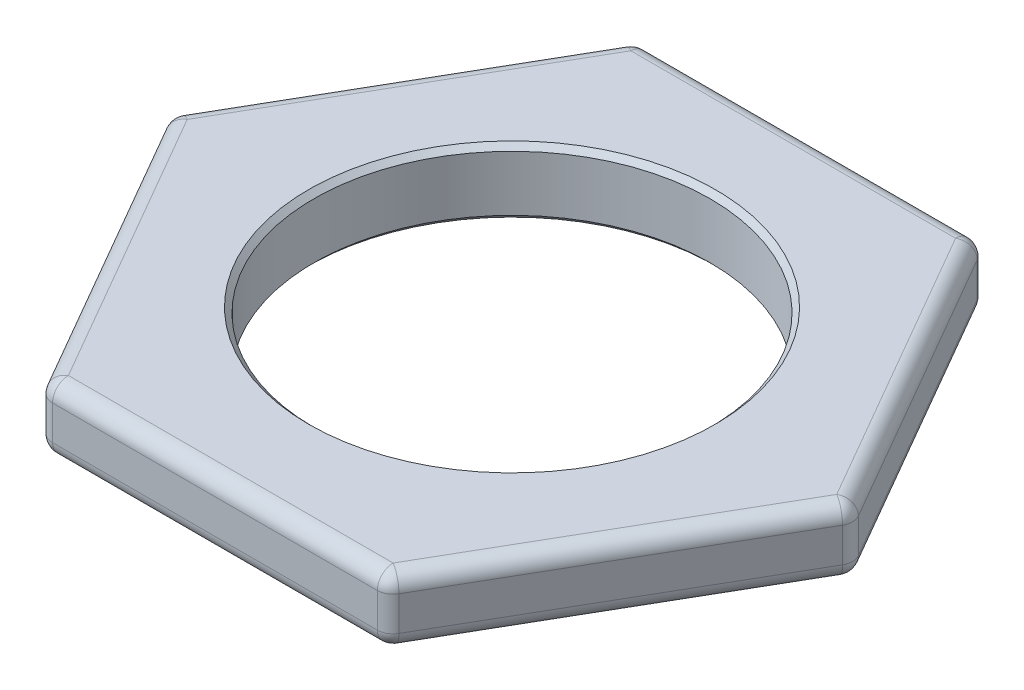
ISO-10303-21;
HEADER;
FILE_DESCRIPTION(('STEP AP214'),'2;1');
FILE_NAME('part.step','',(''),(''),'','','');
FILE_SCHEMA(('AUTOMOTIVE_DESIGN { 1 0 10303 214 1 1 1 1 }'));
ENDSEC;
DATA;
#1=APPLICATION_CONTEXT('core data for automotive mechanical design processes');
#2=APPLICATION_PROTOCOL_DEFINITION('international standard','automotive_design',2000,#1);
#3=PRODUCT_CONTEXT('',#1,'mechanical');
#4=PRODUCT('Part','Part','',(#3));
#5=PRODUCT_RELATED_PRODUCT_CATEGORY('part','',(#4));
#6=PRODUCT_DEFINITION_FORMATION('','',#4);
#7=PRODUCT_DEFINITION_CONTEXT('part definition',#1,'design');
#8=PRODUCT_DEFINITION('design','',#6,#7);
#9=PRODUCT_DEFINITION_SHAPE('','',#8);
#10=(LENGTH_UNIT() NAMED_UNIT(*) SI_UNIT(.MILLI.,.METRE.));
#11=(NAMED_UNIT(*) PLANE_ANGLE_UNIT() SI_UNIT($,.RADIAN.));
#12=(NAMED_UNIT(*) SI_UNIT($,.STERADIAN.) SOLID_ANGLE_UNIT());
#13=UNCERTAINTY_MEASURE_WITH_UNIT(LENGTH_MEASURE(1.E-05),#10,'distance_accuracy_value','');
#14=(GEOMETRIC_REPRESENTATION_CONTEXT(3) GLOBAL_UNCERTAINTY_ASSIGNED_CONTEXT((#13)) GLOBAL_UNIT_ASSIGNED_CONTEXT((#10,
#11,#12)) REPRESENTATION_CONTEXT('',''));
#15=CARTESIAN_POINT('',(0.,0.,0.));
#16=DIRECTION('',(0.,0.,1.));
#17=DIRECTION('',(1.,0.,0.));
#18=AXIS2_PLACEMENT_3D('',#15,#16,#17);
#19=CARTESIAN_POINT('',(0.,3.175,0.));
#20=DIRECTION('',(0.,1.,0.));
#21=DIRECTION('',(0.,0.,1.));
#22=AXIS2_PLACEMENT_3D('',#19,#20,#21);
#23=PLANE('',#22);
#24=DIRECTION('',(-0.5,0.,0.866025403784438));
#25=VECTOR('',#24,1.);
#26=CARTESIAN_POINT('',(-15.8378725844098,3.175,0.380999999999995));
#27=LINE('',#26,#25);
#28=CARTESIAN_POINT('',(-7.80895106592428,3.175,-13.5255));
#29=VERTEX_POINT('',#28);
#30=CARTESIAN_POINT('',(-15.6179021318486,3.175,0.));
#31=VERTEX_POINT('',#30);
#32=EDGE_CURVE('E311',#29,#31,#27,.T.);
#33=ORIENTED_EDGE('',*,*,#32,.T.);
#34=DIRECTION('',(0.5,0.,0.866025403784439));
#35=VECTOR('',#34,1.);
#36=CARTESIAN_POINT('',(-7.58898061336304,3.175,13.9065));
#37=LINE('',#36,#35);
#38=CARTESIAN_POINT('',(-7.80895106592429,3.175,13.5255));
#39=VERTEX_POINT('',#38);
#40=EDGE_CURVE('E313',#31,#39,#37,.T.);
#41=ORIENTED_EDGE('',*,*,#40,.T.);
#42=DIRECTION('',(1.,0.,0.));
#43=VECTOR('',#42,1.);
#44=CARTESIAN_POINT('',(8.24889197104678,3.175,13.5255));
#45=LINE('',#44,#43);
#46=CARTESIAN_POINT('',(7.80895106592428,3.175,13.5255));
#47=VERTEX_POINT('',#46);
#48=EDGE_CURVE('E303',#39,#47,#45,.T.);
#49=ORIENTED_EDGE('',*,*,#48,.T.);
#50=DIRECTION('',(0.5,0.,-0.866025403784439));
#51=VECTOR('',#50,1.);
#52=CARTESIAN_POINT('',(15.8378725844098,3.175,-0.381000000000002));
#53=LINE('',#52,#51);
#54=CARTESIAN_POINT('',(15.6179021318486,3.175,0.));
#55=VERTEX_POINT('',#54);
#56=EDGE_CURVE('E305',#47,#55,#53,.T.);
#57=ORIENTED_EDGE('',*,*,#56,.T.);
#58=DIRECTION('',(-0.5,0.,-0.866025403784439));
#59=VECTOR('',#58,1.);
#60=CARTESIAN_POINT('',(7.58898061336305,3.175,-13.9065));
#61=LINE('',#60,#59);
#62=CARTESIAN_POINT('',(7.80895106592429,3.175,-13.5255));
#63=VERTEX_POINT('',#62);
#64=EDGE_CURVE('E307',#55,#63,#61,.T.);
#65=ORIENTED_EDGE('',*,*,#64,.T.);
#66=DIRECTION('',(-1.,0.,0.));
#67=VECTOR('',#66,1.);
#68=CARTESIAN_POINT('',(-8.24889197104678,3.175,-13.5255));
#69=LINE('',#68,#67);
#70=EDGE_CURVE('E309',#63,#29,#69,.T.);
#71=ORIENTED_EDGE('',*,*,#70,.T.);
#72=EDGE_LOOP('',(#33,#41,#49,#57,#65,#71));
#73=FACE_BOUND('',#72,.T.);
#74=CARTESIAN_POINT('',(0.,3.175,0.));
#75=DIRECTION('',(0.,1.,0.));
#76=DIRECTION('',(0.,0.,1.));
#77=AXIS2_PLACEMENT_3D('',#74,#75,#76);
#78=CIRCLE('',#77,9.77900000000001);
#79=CARTESIAN_POINT('',(0.,3.175,9.77900000000001));
#80=VERTEX_POINT('',#79);
#81=EDGE_CURVE('E180',#80,#80,#78,.F.);
#82=ORIENTED_EDGE('',*,*,#81,.T.);
#83=EDGE_LOOP('',(#82));
#84=FACE_BOUND('',#83,.T.);
#85=ADVANCED_FACE('F35',(#73,#84),#23,.T.);
#86=CARTESIAN_POINT('',(0.,0.,0.));
#87=DIRECTION('',(0.,1.,0.));
#88=DIRECTION('',(0.,0.,1.));
#89=AXIS2_PLACEMENT_3D('',#86,#87,#88);
#90=PLANE('',#89);
#91=DIRECTION('',(1.,0.,0.));
#92=VECTOR('',#91,1.);
#93=CARTESIAN_POINT('',(0.,0.,13.5255));
#94=LINE('',#93,#92);
#95=CARTESIAN_POINT('',(7.80895106592428,0.,13.5255));
#96=VERTEX_POINT('',#95);
#97=CARTESIAN_POINT('',(-7.80895106592429,0.,13.5255));
#98=VERTEX_POINT('',#97);
#99=EDGE_CURVE('E316',#96,#98,#94,.F.);
#100=ORIENTED_EDGE('',*,*,#99,.T.);
#101=DIRECTION('',(0.5,0.,0.866025403784439));
#102=VECTOR('',#101,1.);
#103=CARTESIAN_POINT('',(-11.7134265988864,0.,6.76275));
#104=LINE('',#103,#102);
#105=CARTESIAN_POINT('',(-15.6179021318486,0.,0.));
#106=VERTEX_POINT('',#105);
#107=EDGE_CURVE('E192',#98,#106,#104,.F.);
#108=ORIENTED_EDGE('',*,*,#107,.T.);
#109=DIRECTION('',(-0.5,0.,0.866025403784438));
#110=VECTOR('',#109,1.);
#111=CARTESIAN_POINT('',(-11.7134265988864,0.,-6.76275000000001));
#112=LINE('',#111,#110);
#113=CARTESIAN_POINT('',(-7.80895106592429,0.,-13.5255));
#114=VERTEX_POINT('',#113);
#115=EDGE_CURVE('E324',#106,#114,#112,.F.);
#116=ORIENTED_EDGE('',*,*,#115,.T.);
#117=DIRECTION('',(-1.,0.,0.));
#118=VECTOR('',#117,1.);
#119=CARTESIAN_POINT('',(0.,0.,-13.5255));
#120=LINE('',#119,#118);
#121=CARTESIAN_POINT('',(7.80895106592429,0.,-13.5255));
#122=VERTEX_POINT('',#121);
#123=EDGE_CURVE('E322',#114,#122,#120,.F.);
#124=ORIENTED_EDGE('',*,*,#123,.T.);
#125=DIRECTION('',(-0.5,0.,-0.866025403784439));
#126=VECTOR('',#125,1.);
#127=CARTESIAN_POINT('',(11.7134265988864,0.,-6.76275));
#128=LINE('',#127,#126);
#129=CARTESIAN_POINT('',(15.6179021318486,0.,0.));
#130=VERTEX_POINT('',#129);
#131=EDGE_CURVE('E320',#122,#130,#128,.F.);
#132=ORIENTED_EDGE('',*,*,#131,.T.);
#133=DIRECTION('',(0.5,0.,-0.866025403784439));
#134=VECTOR('',#133,1.);
#135=CARTESIAN_POINT('',(11.7134265988864,0.,6.76275));
#136=LINE('',#135,#134);
#137=EDGE_CURVE('E318',#130,#96,#136,.F.);
#138=ORIENTED_EDGE('',*,*,#137,.T.);
#139=EDGE_LOOP('',(#100,#108,#116,#124,#132,#138));
#140=FACE_BOUND('',#139,.T.);
#141=CARTESIAN_POINT('',(0.,0.,0.));
#142=DIRECTION('',(0.,1.,0.));
#143=DIRECTION('',(0.,0.,1.));
#144=AXIS2_PLACEMENT_3D('',#141,#142,#143);
#145=CIRCLE('',#144,9.779);
#146=CARTESIAN_POINT('',(0.,0.,9.779));
#147=VERTEX_POINT('',#146);
#148=EDGE_CURVE('E274',#147,#147,#145,.T.);
#149=ORIENTED_EDGE('',*,*,#148,.T.);
#150=EDGE_LOOP('',(#149));
#151=FACE_BOUND('',#150,.T.);
#152=ADVANCED_FACE('F397',(#140,#151),#90,.F.);
#153=CARTESIAN_POINT('',(-16.4977839420936,3.175,0.));
#154=DIRECTION('',(0.866025403784439,0.,-0.5));
#155=DIRECTION('',(-0.5,0.,-0.866025403784439));
#156=AXIS2_PLACEMENT_3D('',#153,#154,#155);
#157=PLANE('',#156);
#158=DIRECTION('',(0.5,0.,0.866025403784439));
#159=VECTOR('',#158,1.);
#160=CARTESIAN_POINT('',(-16.4977839420936,2.413,0.));
#161=LINE('',#160,#159);
#162=CARTESIAN_POINT('',(-8.46886242360803,2.413,13.9065));
#163=VERTEX_POINT('',#162);
#164=CARTESIAN_POINT('',(-16.2778134895323,2.413,0.380999999999995));
#165=VERTEX_POINT('',#164);
#166=EDGE_CURVE('E169',#163,#165,#161,.F.);
#167=ORIENTED_EDGE('',*,*,#166,.T.);
#168=DIRECTION('',(0.,-1.,0.));
#169=VECTOR('',#168,1.);
#170=CARTESIAN_POINT('',(-16.2778134895323,3.175,0.380999999999994));
#171=LINE('',#170,#169);
#172=CARTESIAN_POINT('',(-16.2778134895323,0.762,0.380999999999995));
#173=VERTEX_POINT('',#172);
#174=EDGE_CURVE('E165',#165,#173,#171,.T.);
#175=ORIENTED_EDGE('',*,*,#174,.T.);
#176=DIRECTION('',(0.5,0.,0.866025403784439));
#177=VECTOR('',#176,1.);
#178=CARTESIAN_POINT('',(-16.4977839420936,0.762,0.));
#179=LINE('',#178,#177);
#180=CARTESIAN_POINT('',(-8.46886242360803,0.762,13.9065));
#181=VERTEX_POINT('',#180);
#182=EDGE_CURVE('E159',#173,#181,#179,.T.);
#183=ORIENTED_EDGE('',*,*,#182,.T.);
#184=DIRECTION('',(0.,-1.,0.));
#185=VECTOR('',#184,1.);
#186=CARTESIAN_POINT('',(-8.46886242360803,3.175,13.9065));
#187=LINE('',#186,#185);
#188=EDGE_CURVE('E162',#181,#163,#187,.F.);
#189=ORIENTED_EDGE('',*,*,#188,.T.);
#190=EDGE_LOOP('',(#167,#175,#183,#189));
#191=FACE_BOUND('',#190,.T.);
#192=ADVANCED_FACE('F161',(#191),#157,.F.);
#193=CARTESIAN_POINT('',(-8.24889197104678,3.175,14.2875));
#194=DIRECTION('',(0.,0.,-1.));
#195=DIRECTION('',(-1.,0.,0.));
#196=AXIS2_PLACEMENT_3D('',#193,#194,#195);
#197=PLANE('',#196);
#198=DIRECTION('',(0.,-1.,0.));
#199=VECTOR('',#198,1.);
#200=CARTESIAN_POINT('',(-7.80895106592429,3.175,14.2875));
#201=LINE('',#200,#199);
#202=CARTESIAN_POINT('',(-7.80895106592429,2.413,14.2875));
#203=VERTEX_POINT('',#202);
#204=CARTESIAN_POINT('',(-7.80895106592429,0.762,14.2875));
#205=VERTEX_POINT('',#204);
#206=EDGE_CURVE('E55',#203,#205,#201,.T.);
#207=ORIENTED_EDGE('',*,*,#206,.T.);
#208=DIRECTION('',(1.,0.,0.));
#209=VECTOR('',#208,1.);
#210=CARTESIAN_POINT('',(-8.24889197104678,0.762,14.2875));
#211=LINE('',#210,#209);
#212=CARTESIAN_POINT('',(7.80895106592428,0.762,14.2875));
#213=VERTEX_POINT('',#212);
#214=EDGE_CURVE('E11',#205,#213,#211,.T.);
#215=ORIENTED_EDGE('',*,*,#214,.T.);
#216=DIRECTION('',(0.,-1.,0.));
#217=VECTOR('',#216,1.);
#218=CARTESIAN_POINT('',(7.80895106592428,3.175,14.2875));
#219=LINE('',#218,#217);
#220=CARTESIAN_POINT('',(7.80895106592428,2.413,14.2875));
#221=VERTEX_POINT('',#220);
#222=EDGE_CURVE('E44',#213,#221,#219,.F.);
#223=ORIENTED_EDGE('',*,*,#222,.T.);
#224=DIRECTION('',(1.,0.,0.));
#225=VECTOR('',#224,1.);
#226=CARTESIAN_POINT('',(-8.24889197104678,2.413,14.2875));
#227=LINE('',#226,#225);
#228=EDGE_CURVE('E354',#221,#203,#227,.F.);
#229=ORIENTED_EDGE('',*,*,#228,.T.);
#230=EDGE_LOOP('',(#207,#215,#223,#229));
#231=FACE_BOUND('',#230,.T.);
#232=ADVANCED_FACE('F412',(#231),#197,.F.);
#233=CARTESIAN_POINT('',(8.24889197104678,3.175,14.2875));
#234=DIRECTION('',(-0.866025403784438,0.,-0.5));
#235=DIRECTION('',(-0.5,0.,0.866025403784439));
#236=AXIS2_PLACEMENT_3D('',#233,#234,#235);
#237=PLANE('',#236);
#238=DIRECTION('',(0.,-1.,0.));
#239=VECTOR('',#238,1.);
#240=CARTESIAN_POINT('',(8.46886242360802,3.175,13.9065));
#241=LINE('',#240,#239);
#242=CARTESIAN_POINT('',(8.46886242360802,2.413,13.9065));
#243=VERTEX_POINT('',#242);
#244=CARTESIAN_POINT('',(8.46886242360802,0.762,13.9065));
#245=VERTEX_POINT('',#244);
#246=EDGE_CURVE('E347',#243,#245,#241,.T.);
#247=ORIENTED_EDGE('',*,*,#246,.T.);
#248=DIRECTION('',(0.5,0.,-0.866025403784439));
#249=VECTOR('',#248,1.);
#250=CARTESIAN_POINT('',(8.24889197104678,0.762,14.2875));
#251=LINE('',#250,#249);
#252=CARTESIAN_POINT('',(16.2778134895323,0.762,0.381000000000001));
#253=VERTEX_POINT('',#252);
#254=EDGE_CURVE('E352',#245,#253,#251,.T.);
#255=ORIENTED_EDGE('',*,*,#254,.T.);
#256=DIRECTION('',(0.,-1.,0.));
#257=VECTOR('',#256,1.);
#258=CARTESIAN_POINT('',(16.2778134895323,3.175,0.380999999999999));
#259=LINE('',#258,#257);
#260=CARTESIAN_POINT('',(16.2778134895323,2.413,0.381000000000001));
#261=VERTEX_POINT('',#260);
#262=EDGE_CURVE('E349',#253,#261,#259,.F.);
#263=ORIENTED_EDGE('',*,*,#262,.T.);
#264=DIRECTION('',(0.5,0.,-0.866025403784439));
#265=VECTOR('',#264,1.);
#266=CARTESIAN_POINT('',(8.24889197104677,2.413,14.2875));
#267=LINE('',#266,#265);
#268=EDGE_CURVE('E345',#261,#243,#267,.F.);
#269=ORIENTED_EDGE('',*,*,#268,.T.);
#270=EDGE_LOOP('',(#247,#255,#263,#269));
#271=FACE_BOUND('',#270,.T.);
#272=ADVANCED_FACE('F472',(#271),#237,.F.);
#273=CARTESIAN_POINT('',(16.4977839420936,3.175,0.));
#274=DIRECTION('',(-0.866025403784439,0.,0.5));
#275=DIRECTION('',(0.5,0.,0.866025403784439));
#276=AXIS2_PLACEMENT_3D('',#273,#274,#275);
#277=PLANE('',#276);
#278=DIRECTION('',(-0.5,0.,-0.866025403784439));
#279=VECTOR('',#278,1.);
#280=CARTESIAN_POINT('',(16.4977839420936,0.762,0.));
#281=LINE('',#280,#279);
#282=CARTESIAN_POINT('',(16.2778134895323,0.762,-0.381000000000001));
#283=VERTEX_POINT('',#282);
#284=CARTESIAN_POINT('',(8.46886242360804,0.762,-13.9065));
#285=VERTEX_POINT('',#284);
#286=EDGE_CURVE('E340',#283,#285,#281,.T.);
#287=ORIENTED_EDGE('',*,*,#286,.T.);
#288=DIRECTION('',(0.,-1.,0.));
#289=VECTOR('',#288,1.);
#290=CARTESIAN_POINT('',(8.46886242360804,3.175,-13.9065));
#291=LINE('',#290,#289);
#292=CARTESIAN_POINT('',(8.46886242360804,2.413,-13.9065));
#293=VERTEX_POINT('',#292);
#294=EDGE_CURVE('E342',#285,#293,#291,.F.);
#295=ORIENTED_EDGE('',*,*,#294,.T.);
#296=DIRECTION('',(-0.5,0.,-0.866025403784439));
#297=VECTOR('',#296,1.);
#298=CARTESIAN_POINT('',(16.4977839420936,2.413,0.));
#299=LINE('',#298,#297);
#300=CARTESIAN_POINT('',(16.2778134895323,2.413,-0.381000000000001));
#301=VERTEX_POINT('',#300);
#302=EDGE_CURVE('E338',#293,#301,#299,.F.);
#303=ORIENTED_EDGE('',*,*,#302,.T.);
#304=DIRECTION('',(0.,-1.,0.));
#305=VECTOR('',#304,1.);
#306=CARTESIAN_POINT('',(16.2778134895323,3.175,-0.381000000000001));
#307=LINE('',#306,#305);
#308=EDGE_CURVE('E336',#301,#283,#307,.T.);
#309=ORIENTED_EDGE('',*,*,#308,.T.);
#310=EDGE_LOOP('',(#287,#295,#303,#309));
#311=FACE_BOUND('',#310,.T.);
#312=ADVANCED_FACE('F463',(#311),#277,.F.);
#313=CARTESIAN_POINT('',(8.24889197104679,3.175,-14.2875));
#314=DIRECTION('',(0.,0.,1.));
#315=DIRECTION('',(1.,0.,0.));
#316=AXIS2_PLACEMENT_3D('',#313,#314,#315);
#317=PLANE('',#316);
#318=DIRECTION('',(-1.,0.,0.));
#319=VECTOR('',#318,1.);
#320=CARTESIAN_POINT('',(8.24889197104679,0.762,-14.2875));
#321=LINE('',#320,#319);
#322=CARTESIAN_POINT('',(7.80895106592429,0.762,-14.2875));
#323=VERTEX_POINT('',#322);
#324=CARTESIAN_POINT('',(-7.80895106592429,0.762,-14.2875));
#325=VERTEX_POINT('',#324);
#326=EDGE_CURVE('E331',#323,#325,#321,.T.);
#327=ORIENTED_EDGE('',*,*,#326,.T.);
#328=DIRECTION('',(0.,-1.,0.));
#329=VECTOR('',#328,1.);
#330=CARTESIAN_POINT('',(-7.80895106592429,3.175,-14.2875));
#331=LINE('',#330,#329);
#332=CARTESIAN_POINT('',(-7.80895106592429,2.413,-14.2875));
#333=VERTEX_POINT('',#332);
#334=EDGE_CURVE('E333',#325,#333,#331,.F.);
#335=ORIENTED_EDGE('',*,*,#334,.T.);
#336=DIRECTION('',(-1.,0.,0.));
#337=VECTOR('',#336,1.);
#338=CARTESIAN_POINT('',(8.24889197104679,2.413,-14.2875));
#339=LINE('',#338,#337);
#340=CARTESIAN_POINT('',(7.80895106592429,2.413,-14.2875));
#341=VERTEX_POINT('',#340);
#342=EDGE_CURVE('E329',#333,#341,#339,.F.);
#343=ORIENTED_EDGE('',*,*,#342,.T.);
#344=DIRECTION('',(0.,-1.,0.));
#345=VECTOR('',#344,1.);
#346=CARTESIAN_POINT('',(7.80895106592429,3.175,-14.2875));
#347=LINE('',#346,#345);
#348=EDGE_CURVE('E327',#341,#323,#347,.T.);
#349=ORIENTED_EDGE('',*,*,#348,.T.);
#350=EDGE_LOOP('',(#327,#335,#343,#349));
#351=FACE_BOUND('',#350,.T.);
#352=ADVANCED_FACE('F502',(#351),#317,.F.);
#353=CARTESIAN_POINT('',(-8.24889197104678,3.175,-14.2875));
#354=DIRECTION('',(0.866025403784438,0.,0.5));
#355=DIRECTION('',(0.5,0.,-0.866025403784438));
#356=AXIS2_PLACEMENT_3D('',#353,#354,#355);
#357=PLANE('',#356);
#358=DIRECTION('',(-0.5,0.,0.866025403784438));
#359=VECTOR('',#358,1.);
#360=CARTESIAN_POINT('',(-8.24889197104678,0.762,-14.2875));
#361=LINE('',#360,#359);
#362=CARTESIAN_POINT('',(-8.46886242360803,0.762,-13.9065));
#363=VERTEX_POINT('',#362);
#364=CARTESIAN_POINT('',(-16.2778134895323,0.762,-0.381000000000008));
#365=VERTEX_POINT('',#364);
#366=EDGE_CURVE('E298',#363,#365,#361,.T.);
#367=ORIENTED_EDGE('',*,*,#366,.T.);
#368=DIRECTION('',(0.,-1.,0.));
#369=VECTOR('',#368,1.);
#370=CARTESIAN_POINT('',(-16.2778134895323,3.175,-0.381000000000006));
#371=LINE('',#370,#369);
#372=CARTESIAN_POINT('',(-16.2778134895323,2.413,-0.381000000000008));
#373=VERTEX_POINT('',#372);
#374=EDGE_CURVE('E300',#365,#373,#371,.F.);
#375=ORIENTED_EDGE('',*,*,#374,.T.);
#376=DIRECTION('',(-0.5,0.,0.866025403784438));
#377=VECTOR('',#376,1.);
#378=CARTESIAN_POINT('',(-8.24889197104678,2.413,-14.2875));
#379=LINE('',#378,#377);
#380=CARTESIAN_POINT('',(-8.46886242360803,2.413,-13.9065));
#381=VERTEX_POINT('',#380);
#382=EDGE_CURVE('E296',#373,#381,#379,.F.);
#383=ORIENTED_EDGE('',*,*,#382,.T.);
#384=DIRECTION('',(0.,-1.,0.));
#385=VECTOR('',#384,1.);
#386=CARTESIAN_POINT('',(-8.46886242360803,3.175,-13.9065));
#387=LINE('',#386,#385);
#388=EDGE_CURVE('E294',#381,#363,#387,.T.);
#389=ORIENTED_EDGE('',*,*,#388,.T.);
#390=EDGE_LOOP('',(#367,#375,#383,#389));
#391=FACE_BOUND('',#390,.T.);
#392=ADVANCED_FACE('F383',(#391),#357,.F.);
#393=CARTESIAN_POINT('',(0.,3.175,0.));
#394=DIRECTION('',(0.,-1.,0.));
#395=DIRECTION('',(0.,0.,-1.));
#396=AXIS2_PLACEMENT_3D('',#393,#394,#395);
#397=CYLINDRICAL_SURFACE('',#396,9.525);
#398=CARTESIAN_POINT('',(0.,0.253999999999999,0.));
#399=DIRECTION('',(0.,1.,0.));
#400=DIRECTION('',(0.,0.,1.));
#401=AXIS2_PLACEMENT_3D('',#398,#399,#400);
#402=CIRCLE('',#401,9.525);
#403=CARTESIAN_POINT('',(0.,0.253999999999999,9.525));
#404=VERTEX_POINT('',#403);
#405=EDGE_CURVE('E285',#404,#404,#402,.F.);
#406=ORIENTED_EDGE('',*,*,#405,.T.);
#407=EDGE_LOOP('',(#406));
#408=FACE_BOUND('',#407,.T.);
#409=CARTESIAN_POINT('',(0.,2.92099999999999,0.));
#410=DIRECTION('',(0.,1.,0.));
#411=DIRECTION('',(0.,0.,1.));
#412=AXIS2_PLACEMENT_3D('',#409,#410,#411);
#413=CIRCLE('',#412,9.525);
#414=CARTESIAN_POINT('',(0.,2.92099999999999,9.525));
#415=VERTEX_POINT('',#414);
#416=EDGE_CURVE('E280',#415,#415,#413,.T.);
#417=ORIENTED_EDGE('',*,*,#416,.T.);
#418=EDGE_LOOP('',(#417));
#419=FACE_BOUND('',#418,.T.);
#420=ADVANCED_FACE('F498',(#408,#419),#397,.F.);
#421=CARTESIAN_POINT('',(0.,0.,0.));
#422=DIRECTION('',(0.,-1.,0.));
#423=DIRECTION('',(0.,0.,-1.));
#424=AXIS2_PLACEMENT_3D('',#421,#422,#423);
#425=CONICAL_SURFACE('',#424,9.779,0.785398163397442);
#426=ORIENTED_EDGE('',*,*,#405,.F.);
#427=EDGE_LOOP('',(#426));
#428=FACE_BOUND('',#427,.T.);
#429=ORIENTED_EDGE('',*,*,#148,.F.);
#430=EDGE_LOOP('',(#429));
#431=FACE_BOUND('',#430,.T.);
#432=ADVANCED_FACE('F514',(#428,#431),#425,.F.);
#433=CARTESIAN_POINT('',(0.,2.92099999999999,0.));
#434=DIRECTION('',(0.,1.,0.));
#435=DIRECTION('',(0.,0.,1.));
#436=AXIS2_PLACEMENT_3D('',#433,#434,#435);
#437=CONICAL_SURFACE('',#436,9.525,0.785398163397442);
#438=ORIENTED_EDGE('',*,*,#81,.F.);
#439=EDGE_LOOP('',(#438));
#440=FACE_BOUND('',#439,.T.);
#441=ORIENTED_EDGE('',*,*,#416,.F.);
#442=EDGE_LOOP('',(#441));
#443=FACE_BOUND('',#442,.T.);
#444=ADVANCED_FACE('F517',(#440,#443),#437,.F.);
#445=CARTESIAN_POINT('',(15.6179021318486,3.175,0.));
#446=DIRECTION('',(0.,-1.,0.));
#447=DIRECTION('',(0.,0.,-1.));
#448=AXIS2_PLACEMENT_3D('',#445,#446,#447);
#449=CYLINDRICAL_SURFACE('',#448,0.762);
#450=CARTESIAN_POINT('',(15.6179021318486,2.413,0.));
#451=DIRECTION('',(0.,1.,0.));
#452=DIRECTION('',(0.,0.,1.));
#453=AXIS2_PLACEMENT_3D('',#450,#451,#452);
#454=CIRCLE('',#453,0.762);
#455=EDGE_CURVE('E39',#261,#301,#454,.T.);
#456=ORIENTED_EDGE('',*,*,#455,.F.);
#457=ORIENTED_EDGE('',*,*,#262,.F.);
#458=CARTESIAN_POINT('',(15.6179021318486,0.762,0.));
#459=DIRECTION('',(0.,-1.,0.));
#460=DIRECTION('',(0.,0.,-1.));
#461=AXIS2_PLACEMENT_3D('',#458,#459,#460);
#462=CIRCLE('',#461,0.762);
#463=EDGE_CURVE('E267',#283,#253,#462,.T.);
#464=ORIENTED_EDGE('',*,*,#463,.F.);
#465=ORIENTED_EDGE('',*,*,#308,.F.);
#466=EDGE_LOOP('',(#456,#457,#464,#465));
#467=FACE_BOUND('',#466,.T.);
#468=ADVANCED_FACE('F37',(#467),#449,.T.);
#469=CARTESIAN_POINT('',(15.6179021318486,2.413,0.));
#470=DIRECTION('',(0.,0.,1.));
#471=DIRECTION('',(1.,0.,0.));
#472=AXIS2_PLACEMENT_3D('',#469,#470,#471);
#473=SPHERICAL_SURFACE('',#472,0.762);
#474=CARTESIAN_POINT('',(15.6179021318486,2.413,0.));
#475=DIRECTION('',(0.500000000000002,0.,-0.866025403784437));
#476=DIRECTION('',(-0.866025403784437,0.,-0.500000000000002));
#477=AXIS2_PLACEMENT_3D('',#474,#475,#476);
#478=CIRCLE('',#477,0.762);
#479=EDGE_CURVE('E262',#261,#55,#478,.F.);
#480=ORIENTED_EDGE('',*,*,#479,.F.);
#481=ORIENTED_EDGE('',*,*,#455,.T.);
#482=CARTESIAN_POINT('',(15.6179021318486,2.413,0.));
#483=DIRECTION('',(0.499999999999999,0.,0.866025403784439));
#484=DIRECTION('',(0.866025403784439,0.,-0.499999999999999));
#485=AXIS2_PLACEMENT_3D('',#482,#483,#484);
#486=CIRCLE('',#485,0.762);
#487=EDGE_CURVE('E265',#55,#301,#486,.F.);
#488=ORIENTED_EDGE('',*,*,#487,.F.);
#489=EDGE_LOOP('',(#480,#481,#488));
#490=FACE_BOUND('',#489,.T.);
#491=ADVANCED_FACE('F475',(#490),#473,.T.);
#492=CARTESIAN_POINT('',(15.6179021318486,0.762,0.));
#493=DIRECTION('',(0.,0.,1.));
#494=DIRECTION('',(1.,0.,0.));
#495=AXIS2_PLACEMENT_3D('',#492,#493,#494);
#496=SPHERICAL_SURFACE('',#495,0.762);
#497=CARTESIAN_POINT('',(15.6179021318486,0.762,0.));
#498=DIRECTION('',(0.500000000000002,0.,0.866025403784438));
#499=DIRECTION('',(0.866025403784438,0.,-0.500000000000002));
#500=AXIS2_PLACEMENT_3D('',#497,#498,#499);
#501=CIRCLE('',#500,0.762);
#502=EDGE_CURVE('E256',#283,#130,#501,.F.);
#503=ORIENTED_EDGE('',*,*,#502,.F.);
#504=ORIENTED_EDGE('',*,*,#463,.T.);
#505=CARTESIAN_POINT('',(15.6179021318486,0.762,0.));
#506=DIRECTION('',(0.5,0.,-0.866025403784439));
#507=DIRECTION('',(-0.866025403784439,0.,-0.5));
#508=AXIS2_PLACEMENT_3D('',#505,#506,#507);
#509=CIRCLE('',#508,0.762);
#510=EDGE_CURVE('E259',#130,#253,#509,.F.);
#511=ORIENTED_EDGE('',*,*,#510,.F.);
#512=EDGE_LOOP('',(#503,#504,#511));
#513=FACE_BOUND('',#512,.T.);
#514=ADVANCED_FACE('F467',(#513),#496,.T.);
#515=CARTESIAN_POINT('',(11.7134265988864,2.413,-6.76275));
#516=DIRECTION('',(0.5,0.,0.866025403784439));
#517=DIRECTION('',(0.866025403784439,0.,-0.5));
#518=AXIS2_PLACEMENT_3D('',#515,#516,#517);
#519=CYLINDRICAL_SURFACE('',#518,0.762);
#520=ORIENTED_EDGE('',*,*,#487,.T.);
#521=ORIENTED_EDGE('',*,*,#302,.F.);
#522=CARTESIAN_POINT('',(7.80895106592429,2.413,-13.5255));
#523=DIRECTION('',(-0.500000000000002,0.,-0.866025403784437));
#524=DIRECTION('',(-0.866025403784438,0.,0.500000000000002));
#525=AXIS2_PLACEMENT_3D('',#522,#523,#524);
#526=CIRCLE('',#525,0.762);
#527=EDGE_CURVE('E251',#63,#293,#526,.T.);
#528=ORIENTED_EDGE('',*,*,#527,.F.);
#529=ORIENTED_EDGE('',*,*,#64,.F.);
#530=EDGE_LOOP('',(#520,#521,#528,#529));
#531=FACE_BOUND('',#530,.T.);
#532=ADVANCED_FACE('F477',(#531),#519,.T.);
#533=CARTESIAN_POINT('',(11.7134265988864,2.413,6.76275));
#534=DIRECTION('',(-0.5,0.,0.866025403784439));
#535=DIRECTION('',(0.866025403784438,0.,0.5));
#536=AXIS2_PLACEMENT_3D('',#533,#534,#535);
#537=CYLINDRICAL_SURFACE('',#536,0.762);
#538=ORIENTED_EDGE('',*,*,#479,.T.);
#539=ORIENTED_EDGE('',*,*,#56,.F.);
#540=CARTESIAN_POINT('',(7.80895106592428,2.413,13.5255));
#541=DIRECTION('',(-0.5,0.,0.866025403784439));
#542=DIRECTION('',(0.866025403784439,0.,0.5));
#543=AXIS2_PLACEMENT_3D('',#540,#541,#542);
#544=CIRCLE('',#543,0.762);
#545=EDGE_CURVE('E248',#243,#47,#544,.T.);
#546=ORIENTED_EDGE('',*,*,#545,.F.);
#547=ORIENTED_EDGE('',*,*,#268,.F.);
#548=EDGE_LOOP('',(#538,#539,#546,#547));
#549=FACE_BOUND('',#548,.T.);
#550=ADVANCED_FACE('F474',(#549),#537,.T.);
#551=CARTESIAN_POINT('',(7.80895106592428,3.175,13.5255));
#552=DIRECTION('',(0.,-1.,0.));
#553=DIRECTION('',(0.,0.,-1.));
#554=AXIS2_PLACEMENT_3D('',#551,#552,#553);
#555=CYLINDRICAL_SURFACE('',#554,0.762);
#556=CARTESIAN_POINT('',(7.80895106592428,0.762,13.5255));
#557=DIRECTION('',(0.,-1.,0.));
#558=DIRECTION('',(0.,0.,-1.));
#559=AXIS2_PLACEMENT_3D('',#556,#557,#558);
#560=CIRCLE('',#559,0.762);
#561=EDGE_CURVE('E242',#245,#213,#560,.T.);
#562=ORIENTED_EDGE('',*,*,#561,.F.);
#563=ORIENTED_EDGE('',*,*,#246,.F.);
#564=CARTESIAN_POINT('',(7.80895106592428,2.413,13.5255));
#565=DIRECTION('',(0.,1.,0.));
#566=DIRECTION('',(0.,0.,1.));
#567=AXIS2_PLACEMENT_3D('',#564,#565,#566);
#568=CIRCLE('',#567,0.762);
#569=EDGE_CURVE('E245',#221,#243,#568,.T.);
#570=ORIENTED_EDGE('',*,*,#569,.F.);
#571=ORIENTED_EDGE('',*,*,#222,.F.);
#572=EDGE_LOOP('',(#562,#563,#570,#571));
#573=FACE_BOUND('',#572,.T.);
#574=ADVANCED_FACE('F409',(#573),#555,.T.);
#575=CARTESIAN_POINT('',(7.58898061336303,0.762,13.9065));
#576=DIRECTION('',(0.5,0.,-0.866025403784439));
#577=DIRECTION('',(-0.866025403784438,0.,-0.5));
#578=AXIS2_PLACEMENT_3D('',#575,#576,#577);
#579=CYLINDRICAL_SURFACE('',#578,0.762);
#580=ORIENTED_EDGE('',*,*,#510,.T.);
#581=ORIENTED_EDGE('',*,*,#254,.F.);
#582=CARTESIAN_POINT('',(7.80895106592428,0.762,13.5255));
#583=DIRECTION('',(-0.5,0.,0.866025403784439));
#584=DIRECTION('',(0.866025403784439,0.,0.5));
#585=AXIS2_PLACEMENT_3D('',#582,#583,#584);
#586=CIRCLE('',#585,0.762);
#587=EDGE_CURVE('E239',#96,#245,#586,.T.);
#588=ORIENTED_EDGE('',*,*,#587,.F.);
#589=ORIENTED_EDGE('',*,*,#137,.F.);
#590=EDGE_LOOP('',(#580,#581,#588,#589));
#591=FACE_BOUND('',#590,.T.);
#592=ADVANCED_FACE('F470',(#591),#579,.T.);
#593=CARTESIAN_POINT('',(15.8378725844098,0.762,0.381));
#594=DIRECTION('',(-0.5,0.,-0.866025403784439));
#595=DIRECTION('',(-0.866025403784439,0.,0.5));
#596=AXIS2_PLACEMENT_3D('',#593,#594,#595);
#597=CYLINDRICAL_SURFACE('',#596,0.762);
#598=ORIENTED_EDGE('',*,*,#502,.T.);
#599=ORIENTED_EDGE('',*,*,#131,.F.);
#600=CARTESIAN_POINT('',(7.80895106592429,0.762,-13.5255));
#601=DIRECTION('',(-0.499999999999999,0.,-0.866025403784439));
#602=DIRECTION('',(-0.866025403784439,0.,0.499999999999999));
#603=AXIS2_PLACEMENT_3D('',#600,#601,#602);
#604=CIRCLE('',#603,0.762);
#605=EDGE_CURVE('E236',#285,#122,#604,.T.);
#606=ORIENTED_EDGE('',*,*,#605,.F.);
#607=ORIENTED_EDGE('',*,*,#286,.F.);
#608=EDGE_LOOP('',(#598,#599,#606,#607));
#609=FACE_BOUND('',#608,.T.);
#610=ADVANCED_FACE('F451',(#609),#597,.T.);
#611=CARTESIAN_POINT('',(7.80895106592429,3.175,-13.5255));
#612=DIRECTION('',(0.,-1.,0.));
#613=DIRECTION('',(0.,0.,-1.));
#614=AXIS2_PLACEMENT_3D('',#611,#612,#613);
#615=CYLINDRICAL_SURFACE('',#614,0.762);
#616=CARTESIAN_POINT('',(7.80895106592429,2.413,-13.5255));
#617=DIRECTION('',(0.,1.,0.));
#618=DIRECTION('',(0.,0.,1.));
#619=AXIS2_PLACEMENT_3D('',#616,#617,#618);
#620=CIRCLE('',#619,0.762);
#621=EDGE_CURVE('E253',#293,#341,#620,.T.);
#622=ORIENTED_EDGE('',*,*,#621,.F.);
#623=ORIENTED_EDGE('',*,*,#294,.F.);
#624=CARTESIAN_POINT('',(7.80895106592429,0.762,-13.5255));
#625=DIRECTION('',(0.,-1.,0.));
#626=DIRECTION('',(0.,0.,-1.));
#627=AXIS2_PLACEMENT_3D('',#624,#625,#626);
#628=CIRCLE('',#627,0.762);
#629=EDGE_CURVE('E233',#323,#285,#628,.T.);
#630=ORIENTED_EDGE('',*,*,#629,.F.);
#631=ORIENTED_EDGE('',*,*,#348,.F.);
#632=EDGE_LOOP('',(#622,#623,#630,#631));
#633=FACE_BOUND('',#632,.T.);
#634=ADVANCED_FACE('F460',(#633),#615,.T.);
#635=CARTESIAN_POINT('',(7.80895106592429,2.413,-13.5255));
#636=DIRECTION('',(0.,0.,1.));
#637=DIRECTION('',(1.,0.,0.));
#638=AXIS2_PLACEMENT_3D('',#635,#636,#637);
#639=SPHERICAL_SURFACE('',#638,0.762);
#640=ORIENTED_EDGE('',*,*,#527,.T.);
#641=ORIENTED_EDGE('',*,*,#621,.T.);
#642=CARTESIAN_POINT('',(7.80895106592429,2.413,-13.5255));
#643=DIRECTION('',(1.,0.,0.));
#644=DIRECTION('',(0.,1.,0.));
#645=AXIS2_PLACEMENT_3D('',#642,#643,#644);
#646=CIRCLE('',#645,0.762);
#647=EDGE_CURVE('E230',#63,#341,#646,.F.);
#648=ORIENTED_EDGE('',*,*,#647,.F.);
#649=EDGE_LOOP('',(#640,#641,#648));
#650=FACE_BOUND('',#649,.T.);
#651=ADVANCED_FACE('F480',(#650),#639,.T.);
#652=CARTESIAN_POINT('',(7.80895106592428,2.413,13.5255));
#653=DIRECTION('',(0.,0.,1.));
#654=DIRECTION('',(1.,0.,0.));
#655=AXIS2_PLACEMENT_3D('',#652,#653,#654);
#656=SPHERICAL_SURFACE('',#655,0.762);
#657=ORIENTED_EDGE('',*,*,#569,.T.);
#658=ORIENTED_EDGE('',*,*,#545,.T.);
#659=CARTESIAN_POINT('',(7.80895106592428,2.413,13.5255));
#660=DIRECTION('',(1.,0.,0.));
#661=DIRECTION('',(0.,0.,-1.));
#662=AXIS2_PLACEMENT_3D('',#659,#660,#661);
#663=CIRCLE('',#662,0.762);
#664=EDGE_CURVE('E227',#221,#47,#663,.F.);
#665=ORIENTED_EDGE('',*,*,#664,.F.);
#666=EDGE_LOOP('',(#657,#658,#665));
#667=FACE_BOUND('',#666,.T.);
#668=ADVANCED_FACE('F482',(#667),#656,.T.);
#669=CARTESIAN_POINT('',(7.80895106592428,0.762,13.5255));
#670=DIRECTION('',(0.,0.,1.));
#671=DIRECTION('',(1.,0.,0.));
#672=AXIS2_PLACEMENT_3D('',#669,#670,#671);
#673=SPHERICAL_SURFACE('',#672,0.762);
#674=ORIENTED_EDGE('',*,*,#587,.T.);
#675=ORIENTED_EDGE('',*,*,#561,.T.);
#676=CARTESIAN_POINT('',(7.80895106592428,0.762,13.5255));
#677=DIRECTION('',(1.,0.,0.));
#678=DIRECTION('',(0.,0.,-1.));
#679=AXIS2_PLACEMENT_3D('',#676,#677,#678);
#680=CIRCLE('',#679,0.762);
#681=EDGE_CURVE('E224',#96,#213,#680,.F.);
#682=ORIENTED_EDGE('',*,*,#681,.F.);
#683=EDGE_LOOP('',(#674,#675,#682));
#684=FACE_BOUND('',#683,.T.);
#685=ADVANCED_FACE('F405',(#684),#673,.T.);
#686=CARTESIAN_POINT('',(7.80895106592429,0.762,-13.5255));
#687=DIRECTION('',(0.,0.,1.));
#688=DIRECTION('',(1.,0.,0.));
#689=AXIS2_PLACEMENT_3D('',#686,#687,#688);
#690=SPHERICAL_SURFACE('',#689,0.762);
#691=ORIENTED_EDGE('',*,*,#629,.T.);
#692=ORIENTED_EDGE('',*,*,#605,.T.);
#693=CARTESIAN_POINT('',(7.80895106592429,0.762,-13.5255));
#694=DIRECTION('',(1.,0.,0.));
#695=DIRECTION('',(0.,0.,-1.));
#696=AXIS2_PLACEMENT_3D('',#693,#694,#695);
#697=CIRCLE('',#696,0.762);
#698=EDGE_CURVE('E221',#323,#122,#697,.F.);
#699=ORIENTED_EDGE('',*,*,#698,.F.);
#700=EDGE_LOOP('',(#691,#692,#699));
#701=FACE_BOUND('',#700,.T.);
#702=ADVANCED_FACE('F454',(#701),#690,.T.);
#703=CARTESIAN_POINT('',(0.,2.413,-13.5255));
#704=DIRECTION('',(1.,0.,0.));
#705=DIRECTION('',(0.,0.,-1.));
#706=AXIS2_PLACEMENT_3D('',#703,#704,#705);
#707=CYLINDRICAL_SURFACE('',#706,0.762);
#708=ORIENTED_EDGE('',*,*,#647,.T.);
#709=ORIENTED_EDGE('',*,*,#342,.F.);
#710=CARTESIAN_POINT('',(-7.80895106592428,2.413,-13.5255));
#711=DIRECTION('',(-1.,0.,0.));
#712=DIRECTION('',(0.,0.,1.));
#713=AXIS2_PLACEMENT_3D('',#710,#711,#712);
#714=CIRCLE('',#713,0.762);
#715=EDGE_CURVE('E216',#29,#333,#714,.T.);
#716=ORIENTED_EDGE('',*,*,#715,.F.);
#717=ORIENTED_EDGE('',*,*,#70,.F.);
#718=EDGE_LOOP('',(#708,#709,#716,#717));
#719=FACE_BOUND('',#718,.T.);
#720=ADVANCED_FACE('F433',(#719),#707,.T.);
#721=CARTESIAN_POINT('',(0.,2.413,13.5255));
#722=DIRECTION('',(-1.,0.,0.));
#723=DIRECTION('',(0.,0.,1.));
#724=AXIS2_PLACEMENT_3D('',#721,#722,#723);
#725=CYLINDRICAL_SURFACE('',#724,0.762);
#726=ORIENTED_EDGE('',*,*,#664,.T.);
#727=ORIENTED_EDGE('',*,*,#48,.F.);
#728=CARTESIAN_POINT('',(-7.80895106592429,2.413,13.5255));
#729=DIRECTION('',(-1.,0.,0.));
#730=DIRECTION('',(0.,-1.,0.));
#731=AXIS2_PLACEMENT_3D('',#728,#729,#730);
#732=CIRCLE('',#731,0.762);
#733=EDGE_CURVE('E213',#203,#39,#732,.T.);
#734=ORIENTED_EDGE('',*,*,#733,.F.);
#735=ORIENTED_EDGE('',*,*,#228,.F.);
#736=EDGE_LOOP('',(#726,#727,#734,#735));
#737=FACE_BOUND('',#736,.T.);
#738=ADVANCED_FACE('F417',(#737),#725,.T.);
#739=CARTESIAN_POINT('',(-7.80895106592429,3.175,13.5255));
#740=DIRECTION('',(0.,-1.,0.));
#741=DIRECTION('',(0.,0.,-1.));
#742=AXIS2_PLACEMENT_3D('',#739,#740,#741);
#743=CYLINDRICAL_SURFACE('',#742,0.762);
#744=CARTESIAN_POINT('',(-7.80895106592429,0.762,13.5255));
#745=DIRECTION('',(0.,-1.,0.));
#746=DIRECTION('',(0.,0.,-1.));
#747=AXIS2_PLACEMENT_3D('',#744,#745,#746);
#748=CIRCLE('',#747,0.762);
#749=EDGE_CURVE('E175',#205,#181,#748,.T.);
#750=ORIENTED_EDGE('',*,*,#749,.F.);
#751=ORIENTED_EDGE('',*,*,#206,.F.);
#752=CARTESIAN_POINT('',(-7.80895106592429,2.413,13.5255));
#753=DIRECTION('',(0.,1.,0.));
#754=DIRECTION('',(0.,0.,1.));
#755=AXIS2_PLACEMENT_3D('',#752,#753,#754);
#756=CIRCLE('',#755,0.762);
#757=EDGE_CURVE('E178',#163,#203,#756,.T.);
#758=ORIENTED_EDGE('',*,*,#757,.F.);
#759=ORIENTED_EDGE('',*,*,#188,.F.);
#760=EDGE_LOOP('',(#750,#751,#758,#759));
#761=FACE_BOUND('',#760,.T.);
#762=ADVANCED_FACE('F174',(#761),#743,.T.);
#763=CARTESIAN_POINT('',(-8.24889197104678,0.762,13.5255));
#764=DIRECTION('',(1.,0.,0.));
#765=DIRECTION('',(0.,0.,-1.));
#766=AXIS2_PLACEMENT_3D('',#763,#764,#765);
#767=CYLINDRICAL_SURFACE('',#766,0.762);
#768=ORIENTED_EDGE('',*,*,#681,.T.);
#769=ORIENTED_EDGE('',*,*,#214,.F.);
#770=CARTESIAN_POINT('',(-7.80895106592429,0.762,13.5255));
#771=DIRECTION('',(-1.,0.,0.));
#772=DIRECTION('',(0.,0.,1.));
#773=AXIS2_PLACEMENT_3D('',#770,#771,#772);
#774=CIRCLE('',#773,0.762);
#775=EDGE_CURVE('E188',#98,#205,#774,.T.);
#776=ORIENTED_EDGE('',*,*,#775,.F.);
#777=ORIENTED_EDGE('',*,*,#99,.F.);
#778=EDGE_LOOP('',(#768,#769,#776,#777));
#779=FACE_BOUND('',#778,.T.);
#780=ADVANCED_FACE('F402',(#779),#767,.T.);
#781=CARTESIAN_POINT('',(8.24889197104679,0.762,-13.5255));
#782=DIRECTION('',(-1.,0.,0.));
#783=DIRECTION('',(0.,0.,1.));
#784=AXIS2_PLACEMENT_3D('',#781,#782,#783);
#785=CYLINDRICAL_SURFACE('',#784,0.762);
#786=ORIENTED_EDGE('',*,*,#698,.T.);
#787=ORIENTED_EDGE('',*,*,#123,.F.);
#788=CARTESIAN_POINT('',(-7.80895106592429,0.762,-13.5255));
#789=DIRECTION('',(-1.,0.,0.));
#790=DIRECTION('',(0.,0.,1.));
#791=AXIS2_PLACEMENT_3D('',#788,#789,#790);
#792=CIRCLE('',#791,0.762);
#793=EDGE_CURVE('E208',#325,#114,#792,.T.);
#794=ORIENTED_EDGE('',*,*,#793,.F.);
#795=ORIENTED_EDGE('',*,*,#326,.F.);
#796=EDGE_LOOP('',(#786,#787,#794,#795));
#797=FACE_BOUND('',#796,.T.);
#798=ADVANCED_FACE('F446',(#797),#785,.T.);
#799=CARTESIAN_POINT('',(-7.80895106592429,3.175,-13.5255));
#800=DIRECTION('',(0.,-1.,0.));
#801=DIRECTION('',(0.,0.,-1.));
#802=AXIS2_PLACEMENT_3D('',#799,#800,#801);
#803=CYLINDRICAL_SURFACE('',#802,0.762);
#804=CARTESIAN_POINT('',(-7.80895106592429,2.413,-13.5255));
#805=DIRECTION('',(0.,1.,0.));
#806=DIRECTION('',(0.,0.,1.));
#807=AXIS2_PLACEMENT_3D('',#804,#805,#806);
#808=CIRCLE('',#807,0.762);
#809=EDGE_CURVE('E218',#333,#381,#808,.T.);
#810=ORIENTED_EDGE('',*,*,#809,.F.);
#811=ORIENTED_EDGE('',*,*,#334,.F.);
#812=CARTESIAN_POINT('',(-7.80895106592429,0.762,-13.5255));
#813=DIRECTION('',(0.,-1.,0.));
#814=DIRECTION('',(0.,0.,-1.));
#815=AXIS2_PLACEMENT_3D('',#812,#813,#814);
#816=CIRCLE('',#815,0.762);
#817=EDGE_CURVE('E205',#363,#325,#816,.T.);
#818=ORIENTED_EDGE('',*,*,#817,.F.);
#819=ORIENTED_EDGE('',*,*,#388,.F.);
#820=EDGE_LOOP('',(#810,#811,#818,#819));
#821=FACE_BOUND('',#820,.T.);
#822=ADVANCED_FACE('F439',(#821),#803,.T.);
#823=CARTESIAN_POINT('',(-7.80895106592429,2.413,-13.5255));
#824=DIRECTION('',(0.,0.,1.));
#825=DIRECTION('',(1.,0.,0.));
#826=AXIS2_PLACEMENT_3D('',#823,#824,#825);
#827=SPHERICAL_SURFACE('',#826,0.762);
#828=ORIENTED_EDGE('',*,*,#715,.T.);
#829=ORIENTED_EDGE('',*,*,#809,.T.);
#830=CARTESIAN_POINT('',(-7.80895106592429,2.413,-13.5255));
#831=DIRECTION('',(0.500000000000001,0.,-0.866025403784438));
#832=DIRECTION('',(-0.866025403784438,0.,-0.500000000000001));
#833=AXIS2_PLACEMENT_3D('',#830,#831,#832);
#834=CIRCLE('',#833,0.762);
#835=EDGE_CURVE('E196',#29,#381,#834,.F.);
#836=ORIENTED_EDGE('',*,*,#835,.F.);
#837=EDGE_LOOP('',(#828,#829,#836));
#838=FACE_BOUND('',#837,.T.);
#839=ADVANCED_FACE('F436',(#838),#827,.T.);
#840=CARTESIAN_POINT('',(-7.80895106592429,2.413,13.5255));
#841=DIRECTION('',(0.,0.,1.));
#842=DIRECTION('',(1.,0.,0.));
#843=AXIS2_PLACEMENT_3D('',#840,#841,#842);
#844=SPHERICAL_SURFACE('',#843,0.762);
#845=ORIENTED_EDGE('',*,*,#757,.T.);
#846=ORIENTED_EDGE('',*,*,#733,.T.);
#847=CARTESIAN_POINT('',(-7.80895106592429,2.413,13.5255));
#848=DIRECTION('',(0.499999999999998,0.,0.86602540378444));
#849=DIRECTION('',(0.86602540378444,0.,-0.499999999999998));
#850=AXIS2_PLACEMENT_3D('',#847,#848,#849);
#851=CIRCLE('',#850,0.762);
#852=EDGE_CURVE('E193',#163,#39,#851,.F.);
#853=ORIENTED_EDGE('',*,*,#852,.F.);
#854=EDGE_LOOP('',(#845,#846,#853));
#855=FACE_BOUND('',#854,.T.);
#856=ADVANCED_FACE('F419',(#855),#844,.T.);
#857=CARTESIAN_POINT('',(-7.80895106592429,0.762,13.5255));
#858=DIRECTION('',(0.,0.,1.));
#859=DIRECTION('',(1.,0.,0.));
#860=AXIS2_PLACEMENT_3D('',#857,#858,#859);
#861=SPHERICAL_SURFACE('',#860,0.762);
#862=ORIENTED_EDGE('',*,*,#775,.T.);
#863=ORIENTED_EDGE('',*,*,#749,.T.);
#864=CARTESIAN_POINT('',(-7.80895106592429,0.762,13.5255));
#865=DIRECTION('',(0.5,0.,0.866025403784439));
#866=DIRECTION('',(0.866025403784439,0.,-0.5));
#867=AXIS2_PLACEMENT_3D('',#864,#865,#866);
#868=CIRCLE('',#867,0.762);
#869=EDGE_CURVE('E185',#98,#181,#868,.F.);
#870=ORIENTED_EDGE('',*,*,#869,.F.);
#871=EDGE_LOOP('',(#862,#863,#870));
#872=FACE_BOUND('',#871,.T.);
#873=ADVANCED_FACE('F184',(#872),#861,.T.);
#874=CARTESIAN_POINT('',(-7.80895106592429,0.762,-13.5255));
#875=DIRECTION('',(0.,0.,1.));
#876=DIRECTION('',(1.,0.,0.));
#877=AXIS2_PLACEMENT_3D('',#874,#875,#876);
#878=SPHERICAL_SURFACE('',#877,0.762);
#879=ORIENTED_EDGE('',*,*,#817,.T.);
#880=ORIENTED_EDGE('',*,*,#793,.T.);
#881=CARTESIAN_POINT('',(-7.80895106592429,0.762,-13.5255));
#882=DIRECTION('',(0.499999999999999,0.,-0.866025403784439));
#883=DIRECTION('',(-0.866025403784439,0.,-0.499999999999999));
#884=AXIS2_PLACEMENT_3D('',#881,#882,#883);
#885=CIRCLE('',#884,0.762);
#886=EDGE_CURVE('E194',#363,#114,#885,.F.);
#887=ORIENTED_EDGE('',*,*,#886,.F.);
#888=EDGE_LOOP('',(#879,#880,#887));
#889=FACE_BOUND('',#888,.T.);
#890=ADVANCED_FACE('F443',(#889),#878,.T.);
#891=CARTESIAN_POINT('',(-11.7134265988864,2.413,-6.76275000000001));
#892=DIRECTION('',(0.5,0.,-0.866025403784438));
#893=DIRECTION('',(-0.866025403784438,0.,-0.5));
#894=AXIS2_PLACEMENT_3D('',#891,#892,#893);
#895=CYLINDRICAL_SURFACE('',#894,0.762);
#896=ORIENTED_EDGE('',*,*,#835,.T.);
#897=ORIENTED_EDGE('',*,*,#382,.F.);
#898=CARTESIAN_POINT('',(-15.6179021318486,2.413,0.));
#899=DIRECTION('',(-0.499999999999997,0.,0.86602540378444));
#900=DIRECTION('',(0.866025403784441,0.,0.499999999999997));
#901=AXIS2_PLACEMENT_3D('',#898,#899,#900);
#902=CIRCLE('',#901,0.762);
#903=EDGE_CURVE('E199',#31,#373,#902,.T.);
#904=ORIENTED_EDGE('',*,*,#903,.F.);
#905=ORIENTED_EDGE('',*,*,#32,.F.);
#906=EDGE_LOOP('',(#896,#897,#904,#905));
#907=FACE_BOUND('',#906,.T.);
#908=ADVANCED_FACE('F378',(#907),#895,.T.);
#909=CARTESIAN_POINT('',(-11.7134265988864,2.413,6.76275));
#910=DIRECTION('',(-0.5,0.,-0.866025403784439));
#911=DIRECTION('',(-0.866025403784439,0.,0.5));
#912=AXIS2_PLACEMENT_3D('',#909,#910,#911);
#913=CYLINDRICAL_SURFACE('',#912,0.762);
#914=ORIENTED_EDGE('',*,*,#852,.T.);
#915=ORIENTED_EDGE('',*,*,#40,.F.);
#916=CARTESIAN_POINT('',(-15.6179021318486,2.413,0.));
#917=DIRECTION('',(-0.5,0.,-0.866025403784439));
#918=DIRECTION('',(-0.866025403784439,0.,0.5));
#919=AXIS2_PLACEMENT_3D('',#916,#917,#918);
#920=CIRCLE('',#919,0.762);
#921=EDGE_CURVE('E367',#165,#31,#920,.T.);
#922=ORIENTED_EDGE('',*,*,#921,.F.);
#923=ORIENTED_EDGE('',*,*,#166,.F.);
#924=EDGE_LOOP('',(#914,#915,#922,#923));
#925=FACE_BOUND('',#924,.T.);
#926=ADVANCED_FACE('F423',(#925),#913,.T.);
#927=CARTESIAN_POINT('',(-15.8378725844098,0.762,-0.381000000000006));
#928=DIRECTION('',(0.5,0.,0.866025403784439));
#929=DIRECTION('',(0.866025403784439,0.,-0.5));
#930=AXIS2_PLACEMENT_3D('',#927,#928,#929);
#931=CYLINDRICAL_SURFACE('',#930,0.762);
#932=ORIENTED_EDGE('',*,*,#869,.T.);
#933=ORIENTED_EDGE('',*,*,#182,.F.);
#934=CARTESIAN_POINT('',(-15.6179021318486,0.762,0.));
#935=DIRECTION('',(-0.500000000000003,0.,-0.866025403784437));
#936=DIRECTION('',(-0.866025403784437,0.,0.500000000000003));
#937=AXIS2_PLACEMENT_3D('',#934,#935,#936);
#938=CIRCLE('',#937,0.762);
#939=EDGE_CURVE('E364',#106,#173,#938,.T.);
#940=ORIENTED_EDGE('',*,*,#939,.F.);
#941=ORIENTED_EDGE('',*,*,#107,.F.);
#942=EDGE_LOOP('',(#932,#933,#940,#941));
#943=FACE_BOUND('',#942,.T.);
#944=ADVANCED_FACE('F190',(#943),#931,.T.);
#945=CARTESIAN_POINT('',(-7.58898061336304,0.762,-13.9065));
#946=DIRECTION('',(-0.5,0.,0.866025403784438));
#947=DIRECTION('',(0.866025403784438,0.,0.5));
#948=AXIS2_PLACEMENT_3D('',#945,#946,#947);
#949=CYLINDRICAL_SURFACE('',#948,0.762);
#950=ORIENTED_EDGE('',*,*,#886,.T.);
#951=ORIENTED_EDGE('',*,*,#115,.F.);
#952=CARTESIAN_POINT('',(-15.6179021318486,0.762,0.));
#953=DIRECTION('',(-0.5,0.,0.866025403784439));
#954=DIRECTION('',(0.866025403784439,0.,0.5));
#955=AXIS2_PLACEMENT_3D('',#952,#953,#954);
#956=CIRCLE('',#955,0.762);
#957=EDGE_CURVE('E362',#365,#106,#956,.T.);
#958=ORIENTED_EDGE('',*,*,#957,.F.);
#959=ORIENTED_EDGE('',*,*,#366,.F.);
#960=EDGE_LOOP('',(#950,#951,#958,#959));
#961=FACE_BOUND('',#960,.T.);
#962=ADVANCED_FACE('F393',(#961),#949,.T.);
#963=CARTESIAN_POINT('',(-15.6179021318486,2.413,0.));
#964=DIRECTION('',(0.,0.,1.));
#965=DIRECTION('',(1.,0.,0.));
#966=AXIS2_PLACEMENT_3D('',#963,#964,#965);
#967=SPHERICAL_SURFACE('',#966,0.762);
#968=ORIENTED_EDGE('',*,*,#921,.T.);
#969=ORIENTED_EDGE('',*,*,#903,.T.);
#970=CARTESIAN_POINT('',(-15.6179021318486,2.413,0.));
#971=DIRECTION('',(0.,1.,0.));
#972=DIRECTION('',(0.,0.,1.));
#973=AXIS2_PLACEMENT_3D('',#970,#971,#972);
#974=CIRCLE('',#973,0.762);
#975=EDGE_CURVE('E360',#165,#373,#974,.F.);
#976=ORIENTED_EDGE('',*,*,#975,.F.);
#977=EDGE_LOOP('',(#968,#969,#976));
#978=FACE_BOUND('',#977,.T.);
#979=ADVANCED_FACE('F374',(#978),#967,.T.);
#980=CARTESIAN_POINT('',(-15.6179021318486,0.762,0.));
#981=DIRECTION('',(0.,0.,1.));
#982=DIRECTION('',(1.,0.,0.));
#983=AXIS2_PLACEMENT_3D('',#980,#981,#982);
#984=SPHERICAL_SURFACE('',#983,0.762);
#985=ORIENTED_EDGE('',*,*,#957,.T.);
#986=ORIENTED_EDGE('',*,*,#939,.T.);
#987=CARTESIAN_POINT('',(-15.6179021318486,0.762,0.));
#988=DIRECTION('',(0.,-1.,0.));
#989=DIRECTION('',(0.,0.,-1.));
#990=AXIS2_PLACEMENT_3D('',#987,#988,#989);
#991=CIRCLE('',#990,0.762);
#992=EDGE_CURVE('E358',#365,#173,#991,.F.);
#993=ORIENTED_EDGE('',*,*,#992,.F.);
#994=EDGE_LOOP('',(#985,#986,#993));
#995=FACE_BOUND('',#994,.T.);
#996=ADVANCED_FACE('F390',(#995),#984,.T.);
#997=CARTESIAN_POINT('',(-15.6179021318486,3.175,0.));
#998=DIRECTION('',(0.,-1.,0.));
#999=DIRECTION('',(0.,0.,-1.));
#1000=AXIS2_PLACEMENT_3D('',#997,#998,#999);
#1001=CYLINDRICAL_SURFACE('',#1000,0.762);
#1002=ORIENTED_EDGE('',*,*,#975,.T.);
#1003=ORIENTED_EDGE('',*,*,#374,.F.);
#1004=ORIENTED_EDGE('',*,*,#992,.T.);
#1005=ORIENTED_EDGE('',*,*,#174,.F.);
#1006=EDGE_LOOP('',(#1002,#1003,#1004,#1005));
#1007=FACE_BOUND('',#1006,.T.);
#1008=ADVANCED_FACE('F388',(#1007),#1001,.T.);
#1009=CLOSED_SHELL('',(#85,#152,#192,#232,#272,#312,#352,#392,#420,#432,#444,#468,#491,#514,
#532,#550,#574,#592,#610,#634,#651,#668,#685,#702,#720,#738,#762,#780,#798,#822,#839,#856,#873,
#890,#908,#926,#944,#962,#979,#996,#1008));
#1010=MANIFOLD_SOLID_BREP('B2',#1009);
#1011=ADVANCED_BREP_SHAPE_REPRESENTATION('',(#18,#1010),#14);
#1012=SHAPE_DEFINITION_REPRESENTATION(#9,#1011);
ENDSEC;
END-ISO-10303-21;
